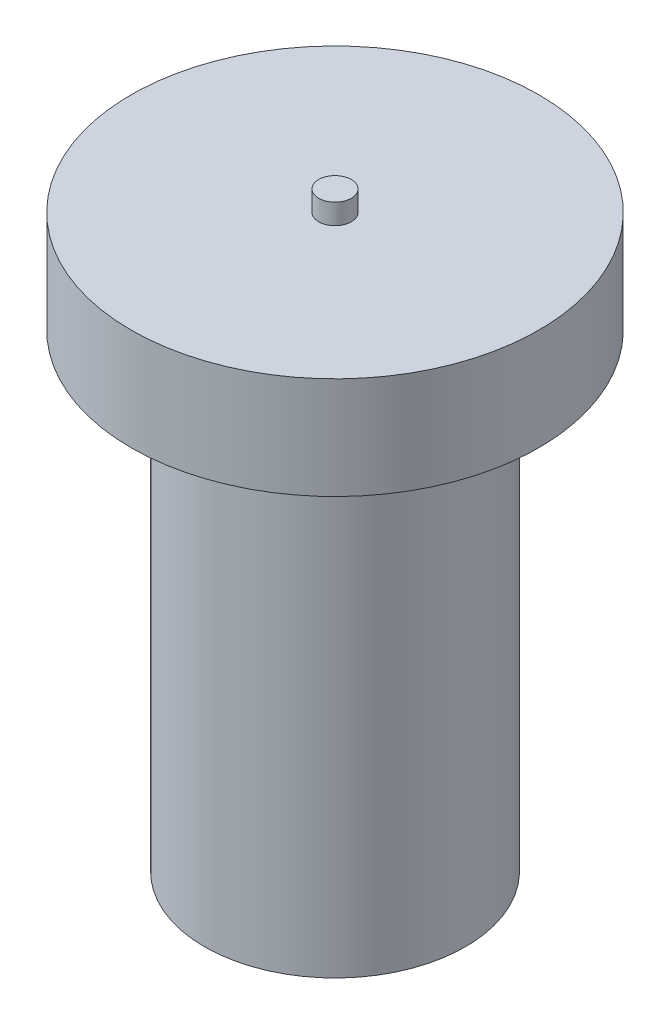
ISO-10303-21;
HEADER;
FILE_DESCRIPTION(('STEP AP214'),'2;1');
FILE_NAME('part.step','',(''),(''),'','','');
FILE_SCHEMA(('AUTOMOTIVE_DESIGN { 1 0 10303 214 1 1 1 1 }'));
ENDSEC;
DATA;
#1=APPLICATION_CONTEXT('core data for automotive mechanical design processes');
#2=APPLICATION_PROTOCOL_DEFINITION('international standard','automotive_design',2000,#1);
#3=PRODUCT_CONTEXT('',#1,'mechanical');
#4=PRODUCT('Part','Part','',(#3));
#5=PRODUCT_RELATED_PRODUCT_CATEGORY('part','',(#4));
#6=PRODUCT_DEFINITION_FORMATION('','',#4);
#7=PRODUCT_DEFINITION_CONTEXT('part definition',#1,'design');
#8=PRODUCT_DEFINITION('design','',#6,#7);
#9=PRODUCT_DEFINITION_SHAPE('','',#8);
#10=(LENGTH_UNIT() NAMED_UNIT(*) SI_UNIT(.MILLI.,.METRE.));
#11=(NAMED_UNIT(*) PLANE_ANGLE_UNIT() SI_UNIT($,.RADIAN.));
#12=(NAMED_UNIT(*) SI_UNIT($,.STERADIAN.) SOLID_ANGLE_UNIT());
#13=UNCERTAINTY_MEASURE_WITH_UNIT(LENGTH_MEASURE(1.E-05),#10,'distance_accuracy_value','');
#14=(GEOMETRIC_REPRESENTATION_CONTEXT(3) GLOBAL_UNCERTAINTY_ASSIGNED_CONTEXT((#13)) GLOBAL_UNIT_ASSIGNED_CONTEXT((#10,
#11,#12)) REPRESENTATION_CONTEXT('',''));
#15=CARTESIAN_POINT('',(0.,0.,0.));
#16=DIRECTION('',(0.,0.,1.));
#17=DIRECTION('',(1.,0.,0.));
#18=AXIS2_PLACEMENT_3D('',#15,#16,#17);
#19=CARTESIAN_POINT('',(0.,110.,0.));
#20=DIRECTION('',(0.,-1.,0.));
#21=DIRECTION('',(0.,0.,-1.));
#22=AXIS2_PLACEMENT_3D('',#19,#20,#21);
#23=CYLINDRICAL_SURFACE('',#22,32.);
#24=CARTESIAN_POINT('',(0.,110.,0.));
#25=DIRECTION('',(0.,1.,0.));
#26=DIRECTION('',(0.,0.,1.));
#27=AXIS2_PLACEMENT_3D('',#24,#25,#26);
#28=CIRCLE('',#27,32.);
#29=CARTESIAN_POINT('',(0.,110.,32.));
#30=VERTEX_POINT('',#29);
#31=EDGE_CURVE('E51',#30,#30,#28,.T.);
#32=ORIENTED_EDGE('',*,*,#31,.F.);
#33=EDGE_LOOP('',(#32));
#34=FACE_BOUND('',#33,.T.);
#35=CARTESIAN_POINT('',(0.,0.,0.));
#36=DIRECTION('',(0.,1.,0.));
#37=DIRECTION('',(0.,0.,1.));
#38=AXIS2_PLACEMENT_3D('',#35,#36,#37);
#39=CIRCLE('',#38,32.);
#40=CARTESIAN_POINT('',(0.,0.,32.));
#41=VERTEX_POINT('',#40);
#42=EDGE_CURVE('E40',#41,#41,#39,.T.);
#43=ORIENTED_EDGE('',*,*,#42,.T.);
#44=EDGE_LOOP('',(#43));
#45=FACE_BOUND('',#44,.T.);
#46=ADVANCED_FACE('F37',(#34,#45),#23,.T.);
#47=CARTESIAN_POINT('',(0.,110.,0.));
#48=DIRECTION('',(0.,1.,0.));
#49=DIRECTION('',(0.,0.,1.));
#50=AXIS2_PLACEMENT_3D('',#47,#48,#49);
#51=PLANE('',#50);
#52=CARTESIAN_POINT('',(0.,110.,0.));
#53=DIRECTION('',(0.,1.,0.));
#54=DIRECTION('',(0.,0.,1.));
#55=AXIS2_PLACEMENT_3D('',#52,#53,#54);
#56=CIRCLE('',#55,5.);
#57=CARTESIAN_POINT('',(0.,110.,5.));
#58=VERTEX_POINT('',#57);
#59=EDGE_CURVE('E45',#58,#58,#56,.T.);
#60=ORIENTED_EDGE('',*,*,#59,.F.);
#61=EDGE_LOOP('',(#60));
#62=FACE_BOUND('',#61,.T.);
#63=ORIENTED_EDGE('',*,*,#31,.T.);
#64=EDGE_LOOP('',(#63));
#65=FACE_BOUND('',#64,.T.);
#66=ADVANCED_FACE('F87',(#62,#65),#51,.T.);
#67=CARTESIAN_POINT('',(0.,0.,0.));
#68=DIRECTION('',(0.,1.,0.));
#69=DIRECTION('',(0.,0.,1.));
#70=AXIS2_PLACEMENT_3D('',#67,#68,#69);
#71=PLANE('',#70);
#72=CARTESIAN_POINT('',(0.,0.,0.));
#73=DIRECTION('',(0.,-1.,0.));
#74=DIRECTION('',(0.,0.,-1.));
#75=AXIS2_PLACEMENT_3D('',#72,#73,#74);
#76=CIRCLE('',#75,15.);
#77=CARTESIAN_POINT('',(0.,0.,-15.));
#78=VERTEX_POINT('',#77);
#79=EDGE_CURVE('E10',#78,#78,#76,.T.);
#80=ORIENTED_EDGE('',*,*,#79,.F.);
#81=EDGE_LOOP('',(#80));
#82=FACE_BOUND('',#81,.T.);
#83=ORIENTED_EDGE('',*,*,#42,.F.);
#84=EDGE_LOOP('',(#83));
#85=FACE_BOUND('',#84,.T.);
#86=ADVANCED_FACE('F84',(#82,#85),#71,.F.);
#87=CARTESIAN_POINT('',(0.,115.,0.));
#88=DIRECTION('',(0.,-1.,0.));
#89=DIRECTION('',(0.,0.,-1.));
#90=AXIS2_PLACEMENT_3D('',#87,#88,#89);
#91=CYLINDRICAL_SURFACE('',#90,5.);
#92=CARTESIAN_POINT('',(0.,115.,0.));
#93=DIRECTION('',(0.,1.,0.));
#94=DIRECTION('',(0.,0.,1.));
#95=AXIS2_PLACEMENT_3D('',#92,#93,#94);
#96=CIRCLE('',#95,5.);
#97=CARTESIAN_POINT('',(0.,115.,5.));
#98=VERTEX_POINT('',#97);
#99=EDGE_CURVE('E69',#98,#98,#96,.T.);
#100=ORIENTED_EDGE('',*,*,#99,.F.);
#101=EDGE_LOOP('',(#100));
#102=FACE_BOUND('',#101,.T.);
#103=ORIENTED_EDGE('',*,*,#59,.T.);
#104=EDGE_LOOP('',(#103));
#105=FACE_BOUND('',#104,.T.);
#106=ADVANCED_FACE('F86',(#102,#105),#91,.T.);
#107=CARTESIAN_POINT('',(0.,140.,0.));
#108=DIRECTION('',(0.,-1.,0.));
#109=DIRECTION('',(0.,0.,-1.));
#110=AXIS2_PLACEMENT_3D('',#107,#108,#109);
#111=CYLINDRICAL_SURFACE('',#110,50.);
#112=CARTESIAN_POINT('',(0.,140.,0.));
#113=DIRECTION('',(0.,1.,0.));
#114=DIRECTION('',(0.,0.,1.));
#115=AXIS2_PLACEMENT_3D('',#112,#113,#114);
#116=CIRCLE('',#115,50.);
#117=CARTESIAN_POINT('',(0.,140.,50.));
#118=VERTEX_POINT('',#117);
#119=EDGE_CURVE('E65',#118,#118,#116,.T.);
#120=ORIENTED_EDGE('',*,*,#119,.F.);
#121=EDGE_LOOP('',(#120));
#122=FACE_BOUND('',#121,.T.);
#123=CARTESIAN_POINT('',(0.,115.,0.));
#124=DIRECTION('',(0.,1.,0.));
#125=DIRECTION('',(0.,0.,1.));
#126=AXIS2_PLACEMENT_3D('',#123,#124,#125);
#127=CIRCLE('',#126,50.);
#128=CARTESIAN_POINT('',(0.,115.,50.));
#129=VERTEX_POINT('',#128);
#130=EDGE_CURVE('E60',#129,#129,#127,.T.);
#131=ORIENTED_EDGE('',*,*,#130,.T.);
#132=EDGE_LOOP('',(#131));
#133=FACE_BOUND('',#132,.T.);
#134=ADVANCED_FACE('F93',(#122,#133),#111,.T.);
#135=CARTESIAN_POINT('',(0.,140.,0.));
#136=DIRECTION('',(0.,1.,0.));
#137=DIRECTION('',(0.,0.,1.));
#138=AXIS2_PLACEMENT_3D('',#135,#136,#137);
#139=PLANE('',#138);
#140=CARTESIAN_POINT('',(0.,140.,0.));
#141=DIRECTION('',(0.,1.,0.));
#142=DIRECTION('',(0.,0.,1.));
#143=AXIS2_PLACEMENT_3D('',#140,#141,#142);
#144=CIRCLE('',#143,4.);
#145=CARTESIAN_POINT('',(0.,140.,4.));
#146=VERTEX_POINT('',#145);
#147=EDGE_CURVE('E61',#146,#146,#144,.T.);
#148=ORIENTED_EDGE('',*,*,#147,.F.);
#149=EDGE_LOOP('',(#148));
#150=FACE_BOUND('',#149,.T.);
#151=ORIENTED_EDGE('',*,*,#119,.T.);
#152=EDGE_LOOP('',(#151));
#153=FACE_BOUND('',#152,.T.);
#154=ADVANCED_FACE('F122',(#150,#153),#139,.T.);
#155=CARTESIAN_POINT('',(0.,115.,0.));
#156=DIRECTION('',(0.,1.,0.));
#157=DIRECTION('',(0.,0.,1.));
#158=AXIS2_PLACEMENT_3D('',#155,#156,#157);
#159=PLANE('',#158);
#160=ORIENTED_EDGE('',*,*,#99,.T.);
#161=EDGE_LOOP('',(#160));
#162=FACE_BOUND('',#161,.T.);
#163=ORIENTED_EDGE('',*,*,#130,.F.);
#164=EDGE_LOOP('',(#163));
#165=FACE_BOUND('',#164,.T.);
#166=ADVANCED_FACE('F130',(#162,#165),#159,.F.);
#167=CARTESIAN_POINT('',(0.,145.,0.));
#168=DIRECTION('',(0.,-1.,0.));
#169=DIRECTION('',(0.,0.,-1.));
#170=AXIS2_PLACEMENT_3D('',#167,#168,#169);
#171=CYLINDRICAL_SURFACE('',#170,4.);
#172=CARTESIAN_POINT('',(0.,145.,0.));
#173=DIRECTION('',(0.,1.,0.));
#174=DIRECTION('',(0.,0.,1.));
#175=AXIS2_PLACEMENT_3D('',#172,#173,#174);
#176=CIRCLE('',#175,4.);
#177=CARTESIAN_POINT('',(0.,145.,4.));
#178=VERTEX_POINT('',#177);
#179=EDGE_CURVE('E56',#178,#178,#176,.T.);
#180=ORIENTED_EDGE('',*,*,#179,.F.);
#181=EDGE_LOOP('',(#180));
#182=FACE_BOUND('',#181,.T.);
#183=ORIENTED_EDGE('',*,*,#147,.T.);
#184=EDGE_LOOP('',(#183));
#185=FACE_BOUND('',#184,.T.);
#186=ADVANCED_FACE('F135',(#182,#185),#171,.T.);
#187=CARTESIAN_POINT('',(0.,145.,0.));
#188=DIRECTION('',(0.,1.,0.));
#189=DIRECTION('',(0.,0.,1.));
#190=AXIS2_PLACEMENT_3D('',#187,#188,#189);
#191=PLANE('',#190);
#192=ORIENTED_EDGE('',*,*,#179,.T.);
#193=EDGE_LOOP('',(#192));
#194=FACE_BOUND('',#193,.T.);
#195=ADVANCED_FACE('F152',(#194),#191,.T.);
#196=CARTESIAN_POINT('',(0.,-4.,0.));
#197=DIRECTION('',(0.,1.,0.));
#198=DIRECTION('',(0.,0.,1.));
#199=AXIS2_PLACEMENT_3D('',#196,#197,#198);
#200=CYLINDRICAL_SURFACE('',#199,15.);
#201=CARTESIAN_POINT('',(0.,-4.,0.));
#202=DIRECTION('',(0.,-1.,0.));
#203=DIRECTION('',(0.,0.,-1.));
#204=AXIS2_PLACEMENT_3D('',#201,#202,#203);
#205=CIRCLE('',#204,15.);
#206=CARTESIAN_POINT('',(0.,-4.,-15.));
#207=VERTEX_POINT('',#206);
#208=EDGE_CURVE('E55',#207,#207,#205,.T.);
#209=ORIENTED_EDGE('',*,*,#208,.F.);
#210=EDGE_LOOP('',(#209));
#211=FACE_BOUND('',#210,.T.);
#212=ORIENTED_EDGE('',*,*,#79,.T.);
#213=EDGE_LOOP('',(#212));
#214=FACE_BOUND('',#213,.T.);
#215=ADVANCED_FACE('F161',(#211,#214),#200,.T.);
#216=CARTESIAN_POINT('',(0.,-4.,0.));
#217=DIRECTION('',(0.,-1.,0.));
#218=DIRECTION('',(0.,0.,-1.));
#219=AXIS2_PLACEMENT_3D('',#216,#217,#218);
#220=PLANE('',#219);
#221=ORIENTED_EDGE('',*,*,#208,.T.);
#222=EDGE_LOOP('',(#221));
#223=FACE_BOUND('',#222,.T.);
#224=ADVANCED_FACE('F175',(#223),#220,.T.);
#225=CLOSED_SHELL('',(#46,#66,#86,#106,#134,#154,#166,#186,#195,#215,#224));
#226=MANIFOLD_SOLID_BREP('B2',#225);
#227=ADVANCED_BREP_SHAPE_REPRESENTATION('',(#18,#226),#14);
#228=SHAPE_DEFINITION_REPRESENTATION(#9,#227);
ENDSEC;
END-ISO-10303-21;
